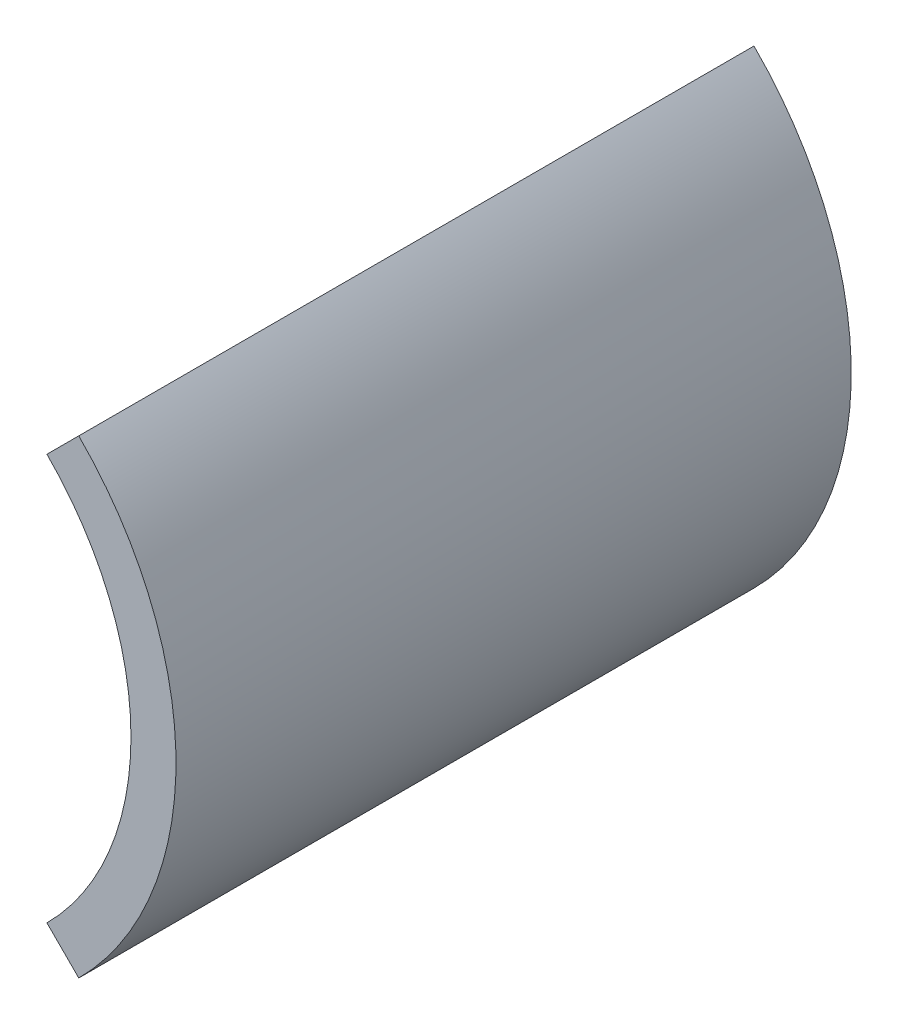
ISO-10303-21;
HEADER;
FILE_DESCRIPTION(('STEP AP214'),'2;1');
FILE_NAME('part.step','',(''),(''),'','','');
FILE_SCHEMA(('AUTOMOTIVE_DESIGN { 1 0 10303 214 1 1 1 1 }'));
ENDSEC;
DATA;
#1=APPLICATION_CONTEXT('core data for automotive mechanical design processes');
#2=APPLICATION_PROTOCOL_DEFINITION('international standard','automotive_design',2000,#1);
#3=PRODUCT_CONTEXT('',#1,'mechanical');
#4=PRODUCT('Part','Part','',(#3));
#5=PRODUCT_RELATED_PRODUCT_CATEGORY('part','',(#4));
#6=PRODUCT_DEFINITION_FORMATION('','',#4);
#7=PRODUCT_DEFINITION_CONTEXT('part definition',#1,'design');
#8=PRODUCT_DEFINITION('design','',#6,#7);
#9=PRODUCT_DEFINITION_SHAPE('','',#8);
#10=(LENGTH_UNIT() NAMED_UNIT(*) SI_UNIT(.MILLI.,.METRE.));
#11=(NAMED_UNIT(*) PLANE_ANGLE_UNIT() SI_UNIT($,.RADIAN.));
#12=(NAMED_UNIT(*) SI_UNIT($,.STERADIAN.) SOLID_ANGLE_UNIT());
#13=UNCERTAINTY_MEASURE_WITH_UNIT(LENGTH_MEASURE(1.E-05),#10,'distance_accuracy_value','');
#14=(GEOMETRIC_REPRESENTATION_CONTEXT(3) GLOBAL_UNCERTAINTY_ASSIGNED_CONTEXT((#13)) GLOBAL_UNIT_ASSIGNED_CONTEXT((#10,
#11,#12)) REPRESENTATION_CONTEXT('',''));
#15=CARTESIAN_POINT('',(0.,0.,0.));
#16=DIRECTION('',(0.,0.,1.));
#17=DIRECTION('',(1.,0.,0.));
#18=AXIS2_PLACEMENT_3D('',#15,#16,#17);
#19=CARTESIAN_POINT('',(0.,0.,15.));
#20=DIRECTION('',(0.,0.,-1.));
#21=DIRECTION('',(-1.,0.,0.));
#22=AXIS2_PLACEMENT_3D('',#19,#20,#21);
#23=CYLINDRICAL_SURFACE('',#22,12.75);
#24=CARTESIAN_POINT('',(0.,0.,-15.));
#25=DIRECTION('',(0.,0.,-1.));
#26=DIRECTION('',(1.,0.,0.));
#27=AXIS2_PLACEMENT_3D('',#24,#25,#26);
#28=CIRCLE('',#27,12.75);
#29=CARTESIAN_POINT('',(9.01561146012846,9.0156114601285,-15.));
#30=VERTEX_POINT('',#29);
#31=CARTESIAN_POINT('',(9.01561146012846,-9.0156114601285,-15.));
#32=VERTEX_POINT('',#31);
#33=EDGE_CURVE('E99',#30,#32,#28,.T.);
#34=ORIENTED_EDGE('',*,*,#33,.T.);
#35=DIRECTION('',(0.,0.,-1.));
#36=VECTOR('',#35,1.);
#37=CARTESIAN_POINT('',(9.01561146012846,-9.0156114601285,15.));
#38=LINE('',#37,#36);
#39=CARTESIAN_POINT('',(9.01561146012846,-9.0156114601285,15.));
#40=VERTEX_POINT('',#39);
#41=EDGE_CURVE('E11',#40,#32,#38,.T.);
#42=ORIENTED_EDGE('',*,*,#41,.F.);
#43=CARTESIAN_POINT('',(0.,0.,15.));
#44=DIRECTION('',(0.,0.,-1.));
#45=DIRECTION('',(1.,0.,0.));
#46=AXIS2_PLACEMENT_3D('',#43,#44,#45);
#47=CIRCLE('',#46,12.75);
#48=CARTESIAN_POINT('',(9.01561146012846,9.0156114601285,15.));
#49=VERTEX_POINT('',#48);
#50=EDGE_CURVE('E87',#49,#40,#47,.T.);
#51=ORIENTED_EDGE('',*,*,#50,.F.);
#52=DIRECTION('',(0.,0.,-1.));
#53=VECTOR('',#52,1.);
#54=CARTESIAN_POINT('',(9.01561146012846,9.0156114601285,15.));
#55=LINE('',#54,#53);
#56=EDGE_CURVE('E95',#49,#30,#55,.T.);
#57=ORIENTED_EDGE('',*,*,#56,.T.);
#58=EDGE_LOOP('',(#34,#42,#51,#57));
#59=FACE_BOUND('',#58,.T.);
#60=ADVANCED_FACE('F36',(#59),#23,.F.);
#61=CARTESIAN_POINT('',(9.01561146012846,-9.0156114601285,15.));
#62=DIRECTION('',(0.707106781186549,0.707106781186546,0.));
#63=DIRECTION('',(-0.707106781186546,0.707106781186549,0.));
#64=AXIS2_PLACEMENT_3D('',#61,#62,#63);
#65=PLANE('',#64);
#66=DIRECTION('',(0.707106781186546,-0.707106781186549,0.));
#67=VECTOR('',#66,1.);
#68=CARTESIAN_POINT('',(9.01561146012846,-9.0156114601285,-15.));
#69=LINE('',#68,#67);
#70=CARTESIAN_POINT('',(10.4298250225016,-10.4298250225016,-15.));
#71=VERTEX_POINT('',#70);
#72=EDGE_CURVE('E91',#32,#71,#69,.T.);
#73=ORIENTED_EDGE('',*,*,#72,.T.);
#74=DIRECTION('',(0.,0.,-1.));
#75=VECTOR('',#74,1.);
#76=CARTESIAN_POINT('',(10.4298250225016,-10.4298250225016,15.));
#77=LINE('',#76,#75);
#78=CARTESIAN_POINT('',(10.4298250225016,-10.4298250225016,15.));
#79=VERTEX_POINT('',#78);
#80=EDGE_CURVE('E44',#79,#71,#77,.T.);
#81=ORIENTED_EDGE('',*,*,#80,.F.);
#82=DIRECTION('',(0.707106781186546,-0.707106781186549,0.));
#83=VECTOR('',#82,1.);
#84=CARTESIAN_POINT('',(9.01561146012846,-9.0156114601285,15.));
#85=LINE('',#84,#83);
#86=EDGE_CURVE('E82',#40,#79,#85,.T.);
#87=ORIENTED_EDGE('',*,*,#86,.F.);
#88=ORIENTED_EDGE('',*,*,#41,.T.);
#89=EDGE_LOOP('',(#73,#81,#87,#88));
#90=FACE_BOUND('',#89,.T.);
#91=ADVANCED_FACE('F90',(#90),#65,.F.);
#92=CARTESIAN_POINT('',(0.,0.,15.));
#93=DIRECTION('',(0.,0.,-1.));
#94=DIRECTION('',(-1.,0.,0.));
#95=AXIS2_PLACEMENT_3D('',#92,#93,#94);
#96=CYLINDRICAL_SURFACE('',#95,14.75);
#97=CARTESIAN_POINT('',(0.,0.,-15.));
#98=DIRECTION('',(0.,0.,1.));
#99=DIRECTION('',(1.,0.,0.));
#100=AXIS2_PLACEMENT_3D('',#97,#98,#99);
#101=CIRCLE('',#100,14.75);
#102=CARTESIAN_POINT('',(10.4298250225016,10.4298250225016,-15.));
#103=VERTEX_POINT('',#102);
#104=EDGE_CURVE('E69',#71,#103,#101,.T.);
#105=ORIENTED_EDGE('',*,*,#104,.T.);
#106=DIRECTION('',(0.,0.,-1.));
#107=VECTOR('',#106,1.);
#108=CARTESIAN_POINT('',(10.4298250225016,10.4298250225016,15.));
#109=LINE('',#108,#107);
#110=CARTESIAN_POINT('',(10.4298250225016,10.4298250225016,15.));
#111=VERTEX_POINT('',#110);
#112=EDGE_CURVE('E92',#111,#103,#109,.T.);
#113=ORIENTED_EDGE('',*,*,#112,.F.);
#114=CARTESIAN_POINT('',(0.,0.,15.));
#115=DIRECTION('',(0.,0.,1.));
#116=DIRECTION('',(1.,0.,0.));
#117=AXIS2_PLACEMENT_3D('',#114,#115,#116);
#118=CIRCLE('',#117,14.75);
#119=EDGE_CURVE('E85',#79,#111,#118,.T.);
#120=ORIENTED_EDGE('',*,*,#119,.F.);
#121=ORIENTED_EDGE('',*,*,#80,.T.);
#122=EDGE_LOOP('',(#105,#113,#120,#121));
#123=FACE_BOUND('',#122,.T.);
#124=ADVANCED_FACE('F93',(#123),#96,.T.);
#125=CARTESIAN_POINT('',(9.01561146012846,9.0156114601285,15.));
#126=DIRECTION('',(0.707106781186549,-0.707106781186546,0.));
#127=DIRECTION('',(0.707106781186546,0.707106781186549,0.));
#128=AXIS2_PLACEMENT_3D('',#125,#126,#127);
#129=PLANE('',#128);
#130=DIRECTION('',(-0.707106781186546,-0.707106781186549,0.));
#131=VECTOR('',#130,1.);
#132=CARTESIAN_POINT('',(9.01561146012846,9.0156114601285,-15.));
#133=LINE('',#132,#131);
#134=EDGE_CURVE('E75',#103,#30,#133,.T.);
#135=ORIENTED_EDGE('',*,*,#134,.T.);
#136=ORIENTED_EDGE('',*,*,#56,.F.);
#137=DIRECTION('',(-0.707106781186546,-0.707106781186549,0.));
#138=VECTOR('',#137,1.);
#139=CARTESIAN_POINT('',(9.01561146012846,9.0156114601285,15.));
#140=LINE('',#139,#138);
#141=EDGE_CURVE('E52',#111,#49,#140,.T.);
#142=ORIENTED_EDGE('',*,*,#141,.F.);
#143=ORIENTED_EDGE('',*,*,#112,.T.);
#144=EDGE_LOOP('',(#135,#136,#142,#143));
#145=FACE_BOUND('',#144,.T.);
#146=ADVANCED_FACE('F106',(#145),#129,.F.);
#147=CARTESIAN_POINT('',(0.,0.,15.));
#148=DIRECTION('',(0.,0.,1.));
#149=DIRECTION('',(1.,0.,0.));
#150=AXIS2_PLACEMENT_3D('',#147,#148,#149);
#151=PLANE('',#150);
#152=ORIENTED_EDGE('',*,*,#50,.T.);
#153=ORIENTED_EDGE('',*,*,#86,.T.);
#154=ORIENTED_EDGE('',*,*,#119,.T.);
#155=ORIENTED_EDGE('',*,*,#141,.T.);
#156=EDGE_LOOP('',(#152,#153,#154,#155));
#157=FACE_BOUND('',#156,.T.);
#158=ADVANCED_FACE('F83',(#157),#151,.T.);
#159=CARTESIAN_POINT('',(0.,0.,-15.));
#160=DIRECTION('',(0.,0.,1.));
#161=DIRECTION('',(1.,0.,0.));
#162=AXIS2_PLACEMENT_3D('',#159,#160,#161);
#163=PLANE('',#162);
#164=ORIENTED_EDGE('',*,*,#33,.F.);
#165=ORIENTED_EDGE('',*,*,#134,.F.);
#166=ORIENTED_EDGE('',*,*,#104,.F.);
#167=ORIENTED_EDGE('',*,*,#72,.F.);
#168=EDGE_LOOP('',(#164,#165,#166,#167));
#169=FACE_BOUND('',#168,.T.);
#170=ADVANCED_FACE('F109',(#169),#163,.F.);
#171=CLOSED_SHELL('',(#60,#91,#124,#146,#158,#170));
#172=MANIFOLD_SOLID_BREP('B2',#171);
#173=ADVANCED_BREP_SHAPE_REPRESENTATION('',(#18,#172),#14);
#174=SHAPE_DEFINITION_REPRESENTATION(#9,#173);
ENDSEC;
END-ISO-10303-21;
